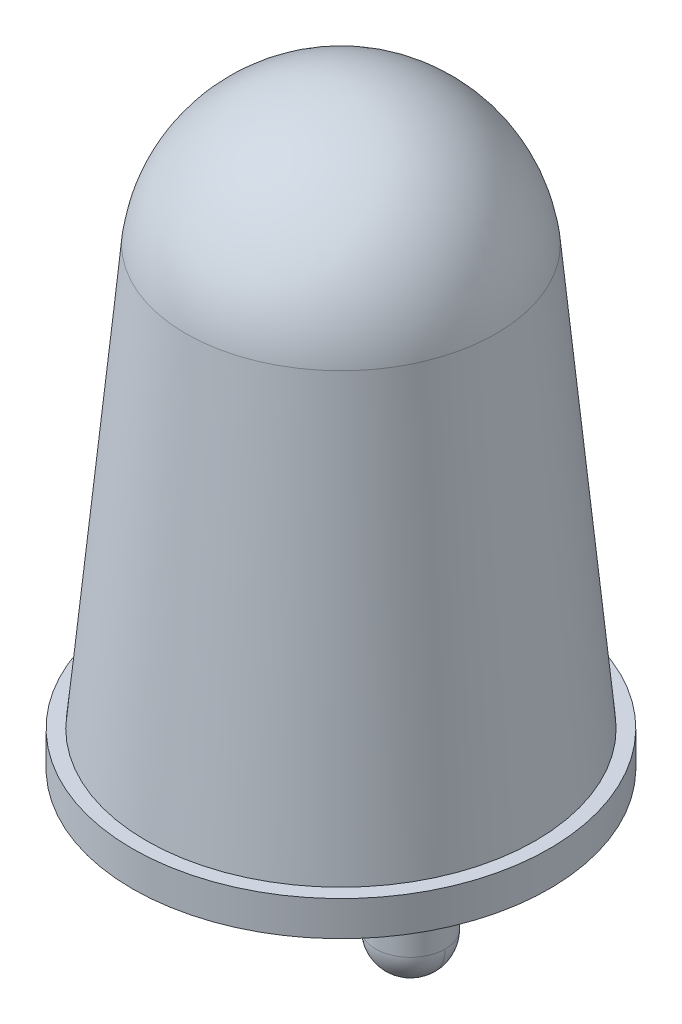
ISO-10303-21;
HEADER;
FILE_DESCRIPTION(('STEP AP214'),'2;1');
FILE_NAME('part.step','',(''),(''),'','','');
FILE_SCHEMA(('AUTOMOTIVE_DESIGN { 1 0 10303 214 1 1 1 1 }'));
ENDSEC;
DATA;
#1=APPLICATION_CONTEXT('core data for automotive mechanical design processes');
#2=APPLICATION_PROTOCOL_DEFINITION('international standard','automotive_design',2000,#1);
#3=PRODUCT_CONTEXT('',#1,'mechanical');
#4=PRODUCT('Part','Part','',(#3));
#5=PRODUCT_RELATED_PRODUCT_CATEGORY('part','',(#4));
#6=PRODUCT_DEFINITION_FORMATION('','',#4);
#7=PRODUCT_DEFINITION_CONTEXT('part definition',#1,'design');
#8=PRODUCT_DEFINITION('design','',#6,#7);
#9=PRODUCT_DEFINITION_SHAPE('','',#8);
#10=(LENGTH_UNIT() NAMED_UNIT(*) SI_UNIT(.MILLI.,.METRE.));
#11=(NAMED_UNIT(*) PLANE_ANGLE_UNIT() SI_UNIT($,.RADIAN.));
#12=(NAMED_UNIT(*) SI_UNIT($,.STERADIAN.) SOLID_ANGLE_UNIT());
#13=UNCERTAINTY_MEASURE_WITH_UNIT(LENGTH_MEASURE(1.E-05),#10,'distance_accuracy_value','');
#14=(GEOMETRIC_REPRESENTATION_CONTEXT(3) GLOBAL_UNCERTAINTY_ASSIGNED_CONTEXT((#13)) GLOBAL_UNIT_ASSIGNED_CONTEXT((#10,
#11,#12)) REPRESENTATION_CONTEXT('',''));
#15=CARTESIAN_POINT('',(0.,0.,0.));
#16=DIRECTION('',(0.,0.,1.));
#17=DIRECTION('',(1.,0.,0.));
#18=AXIS2_PLACEMENT_3D('',#15,#16,#17);
#19=CARTESIAN_POINT('',(-1.,-1.5,0.));
#20=DIRECTION('',(1.,0.,-6.292242297362E-10));
#21=DIRECTION('',(6.292242297362E-10,0.,1.));
#22=AXIS2_PLACEMENT_3D('',#19,#20,#21);
#23=SPHERICAL_SURFACE('',#22,0.5);
#24=CARTESIAN_POINT('',(-0.5,-1.5,-3.14612158236078E-10));
#25=CARTESIAN_POINT('',(-0.499999826455612,-1.50818123913036,3.60818262114439E-08));
#26=CARTESIAN_POINT('',(-0.500200791437424,-1.51636246349381,7.13371394644627E-08));
#27=CARTESIAN_POINT('',(-0.501003752357404,-1.53270521083316,1.39492114832227E-07));
#28=CARTESIAN_POINT('',(-0.501605748295573,-1.54086673380906,1.72391776946973E-07));
#29=CARTESIAN_POINT('',(-0.50320952503223,-1.55715040651965,2.3576204913324E-07));
#30=CARTESIAN_POINT('',(-0.504211305830718,-1.56527255625432,2.66232659204762E-07));
#31=CARTESIAN_POINT('',(-0.506612184204501,-1.58145791819985,3.24685718790203E-07));
#32=CARTESIAN_POINT('',(-0.508011281779797,-1.58952113041069,3.52668168304123E-07));
#33=CARTESIAN_POINT('',(-0.511203437816972,-1.60556919160396,4.06096412620439E-07));
#34=CARTESIAN_POINT('',(-0.512996496278851,-1.61355404058638,4.31542207422835E-07));
#35=CARTESIAN_POINT('',(-0.516972250526604,-1.62942613931517,4.79860348087767E-07));
#36=CARTESIAN_POINT('',(-0.519154946312478,-1.63731338906154,5.02732693950302E-07));
#37=CARTESIAN_POINT('',(-0.523904717955313,-1.65297128819103,5.45878600492865E-07));
#38=CARTESIAN_POINT('',(-0.526471793812275,-1.66074193757416,5.66152161172893E-07));
#39=CARTESIAN_POINT('',(-0.531984141004704,-1.67614791581603,6.04086680887956E-07));
#40=CARTESIAN_POINT('',(-0.534929412340169,-1.68378324467478,6.2174763992299E-07));
#41=CARTESIAN_POINT('',(-0.541191055148543,-1.69890018768818,6.5445458943054E-07));
#42=CARTESIAN_POINT('',(-0.544507426621451,-1.70638180184284,6.69500579903054E-07));
#43=CARTESIAN_POINT('',(-0.551503280255105,-1.72117329158526,6.96986588710274E-07));
#44=CARTESIAN_POINT('',(-0.555182762415851,-1.72848316717301,7.09426607044979E-07));
#45=CARTESIAN_POINT('',(-0.562895973235794,-1.74291356965079,7.31720899558749E-07));
#46=CARTESIAN_POINT('',(-0.566929701894993,-1.75003409654081,7.41575173737814E-07));
#47=CARTESIAN_POINT('',(-0.575341688104735,-1.76406864765023,7.587292679954E-07));
#48=CARTESIAN_POINT('',(-0.57971994565528,-1.77098267186962,7.66029088073921E-07));
#49=CARTESIAN_POINT('',(-0.588810442042175,-1.78458756114783,7.78116418370111E-07));
#50=CARTESIAN_POINT('',(-0.593522680878526,-1.79127842620665,7.82903928587779E-07));
#51=CARTESIAN_POINT('',(-0.603269787640829,-1.80442087828371,7.90019391948207E-07));
#52=CARTESIAN_POINT('',(-0.608304655566782,-1.81087246530197,7.92347345090967E-07));
#53=CARTESIAN_POINT('',(-0.618684891070481,-1.82352081885969,7.94606773948649E-07));
#54=CARTESIAN_POINT('',(-0.624030258648228,-1.82971758539917,7.94538249663571E-07));
#55=CARTESIAN_POINT('',(-0.635018615996813,-1.84184136944597,7.92077812625249E-07));
#56=CARTESIAN_POINT('',(-0.640661605767652,-1.8477683869533,7.89685899872005E-07));
#57=CARTESIAN_POINT('',(-0.6522316130458,-1.8593383942315,7.82661432230481E-07));
#58=CARTESIAN_POINT('',(-0.658158630553109,-1.86498138400236,7.78028877342201E-07));
#59=CARTESIAN_POINT('',(-0.670282414599873,-1.87596974135099,7.6661514467109E-07));
#60=CARTESIAN_POINT('',(-0.67647918113933,-1.88131510892876,7.59833966888258E-07));
#61=CARTESIAN_POINT('',(-0.689127534697025,-1.89169534443251,7.44223863843027E-07));
#62=CARTESIAN_POINT('',(-0.695579121715264,-1.89673021235849,7.35394938580626E-07));
#63=CARTESIAN_POINT('',(-0.708721573792303,-1.90647731912084,7.15798625560007E-07));
#64=CARTESIAN_POINT('',(-0.715412438851104,-1.91118955795722,7.05031237801788E-07));
#65=CARTESIAN_POINT('',(-0.729017328129294,-1.92028005434417,6.81675219136448E-07));
#66=CARTESIAN_POINT('',(-0.735931352348685,-1.92465831189474,6.69086588229327E-07));
#67=CARTESIAN_POINT('',(-0.749965903458094,-1.93307029810453,6.42212734367808E-07));
#68=CARTESIAN_POINT('',(-0.757086430348113,-1.93710402676376,6.27927511413409E-07));
#69=CARTESIAN_POINT('',(-0.771516832825889,-1.94481723758375,5.97792029183163E-07));
#70=CARTESIAN_POINT('',(-0.778826708413647,-1.94849671974452,5.81941769907316E-07));
#71=CARTESIAN_POINT('',(-0.793618198156072,-1.95549257337822,5.4881412427436E-07));
#72=CARTESIAN_POINT('',(-0.80109981231074,-1.95880894485115,5.31536737917252E-07));
#73=CARTESIAN_POINT('',(-0.816216755324171,-1.96507058765957,4.95698528091257E-07));
#74=CARTESIAN_POINT('',(-0.823852084182934,-1.96801585899505,4.77137704622369E-07));
#75=CARTESIAN_POINT('',(-0.839258062424846,-1.97352820618752,4.38881499965969E-07));
#76=CARTESIAN_POINT('',(-0.847028711807996,-1.9760952820445,4.19186118778454E-07));
#77=CARTESIAN_POINT('',(-0.862686610937542,-1.98084505368737,3.78814256649633E-07));
#78=CARTESIAN_POINT('',(-0.870573860683939,-1.98302774947326,3.58137775708325E-07));
#79=CARTESIAN_POINT('',(-0.886445959412797,-1.98700350372105,3.15961127899971E-07));
#80=CARTESIAN_POINT('',(-0.894430808395259,-1.98879656218294,2.94460961032926E-07));
#81=CARTESIAN_POINT('',(-0.910478869588613,-1.99198871822014,2.50797666912879E-07));
#82=CARTESIAN_POINT('',(-0.918542081799506,-1.99338781579545,2.28634539659877E-07));
#83=CARTESIAN_POINT('',(-0.934727443745133,-1.99578869416925,1.83808729850498E-07));
#84=CARTESIAN_POINT('',(-0.942849593479867,-1.99679047496774,1.6114604729412E-07));
#85=CARTESIAN_POINT('',(-0.959133266190573,-1.99839425170441,1.15486491064179E-07));
#86=CARTESIAN_POINT('',(-0.967294789166545,-1.99899624764259,9.24896173906148E-08));
#87=CARTESIAN_POINT('',(-0.983637536506037,-1.99979920856258,4.63285654720946E-08));
#88=CARTESIAN_POINT('',(-0.991818760869555,-2.00000017354439,2.31643872271384E-08));
#89=CARTESIAN_POINT('',(-1.,-2.,0.));
#90=B_SPLINE_CURVE_WITH_KNOTS('',3,(#24,#25,#26,#27,#28,#29,#30,#31,#32,#33,#34,#35,#36,#37,#38,
#39,#40,#41,#42,#43,#44,#45,#46,#47,#48,#49,#50,#51,#52,#53,#54,#55,#56,#57,#58,#59,#60,#61,#62,
#63,#64,#65,#66,#67,#68,#69,#70,#71,#72,#73,#74,#75,#76,#77,#78,#79,#80,#81,#82,#83,#84,#85,#86,
#87,#88,#89),.UNSPECIFIED.,.F.,.F.,(4,2,2,2,2,2,2,2,2,2,2,2,2,2,2,2,2,2,2,2,2,2,2,2,2,2,2,2,2,2,
2,2,4),(0.,0.0245412285229124,0.0490824570458252,0.0736236855687388,0.0981649140916539,
0.122706142614571,0.14724737113749,0.171788599660412,0.196329828183337,0.220871056706266,
0.245412285229198,0.269953513752134,0.294494742275074,0.319035970798019,0.343577199320968,
0.368118427843923,0.392659656366882,0.417200884889845,0.441742113412814,0.466283341935787,
0.490824570458765,0.515365798981748,0.539907027504735,0.564448256027726,0.58898948455072,
0.613530713073718,0.638071941596719,0.662613170119723,0.687154398642728,0.711695627165736,
0.736236855688746,0.760778084211756,0.785319312734766),.UNSPECIFIED.);
#91=CARTESIAN_POINT('',(-0.5,-1.5,-7.86530625211469E-11));
#92=VERTEX_POINT('',#91);
#93=CARTESIAN_POINT('',(-1.,-2.,0.));
#94=VERTEX_POINT('',#93);
#95=EDGE_CURVE('E62',#92,#94,#90,.T.);
#96=ORIENTED_EDGE('',*,*,#95,.F.);
#97=CARTESIAN_POINT('',(-1.,-1.5,0.));
#98=DIRECTION('',(0.,-1.,0.));
#99=DIRECTION('',(0.,0.,-1.));
#100=AXIS2_PLACEMENT_3D('',#97,#98,#99);
#101=CIRCLE('',#100,0.5);
#102=CARTESIAN_POINT('',(-1.5,-1.5,1.1797961674395E-10));
#103=VERTEX_POINT('',#102);
#104=EDGE_CURVE('E57',#103,#92,#101,.F.);
#105=ORIENTED_EDGE('',*,*,#104,.F.);
#106=CARTESIAN_POINT('',(-1.,-2.,0.));
#107=CARTESIAN_POINT('',(-1.00818123913044,-2.00000017354439,-2.31643873372575E-08));
#108=CARTESIAN_POINT('',(-1.01636246349396,-1.99979920856258,-4.63285656224641E-08));
#109=CARTESIAN_POINT('',(-1.03270521083345,-1.99899624764259,-9.24896175843399E-08));
#110=CARTESIAN_POINT('',(-1.04086673380943,-1.99839425170441,-1.15486491261009E-07));
#111=CARTESIAN_POINT('',(-1.05715040652013,-1.99679047496774,-1.61146047440141E-07));
#112=CARTESIAN_POINT('',(-1.06527255625487,-1.99578869416925,-1.83808729942604E-07));
#113=CARTESIAN_POINT('',(-1.08145791820049,-1.99338781579545,-2.28634539688911E-07));
#114=CARTESIAN_POINT('',(-1.08952113041139,-1.99198871822014,-2.50797666932755E-07));
#115=CARTESIAN_POINT('',(-1.10556919160474,-1.98879656218294,-2.94460961133162E-07));
#116=CARTESIAN_POINT('',(-1.1135540405872,-1.98700350372105,-3.15961128089725E-07));
#117=CARTESIAN_POINT('',(-1.12942613931606,-1.98302774947326,-3.58137775852755E-07));
#118=CARTESIAN_POINT('',(-1.13731338906246,-1.98084505368737,-3.78814256659222E-07));
#119=CARTESIAN_POINT('',(-1.152971288192,-1.9760952820445,-4.19186118673573E-07));
#120=CARTESIAN_POINT('',(-1.16074193757515,-1.97352820618752,-4.38881499881456E-07));
#121=CARTESIAN_POINT('',(-1.17614791581707,-1.96801585899505,-4.77137704613123E-07));
#122=CARTESIAN_POINT('',(-1.18378324467583,-1.96507058765957,-4.95698528136907E-07));
#123=CARTESIAN_POINT('',(-1.19890018768926,-1.95880894485115,-5.31536737984744E-07));
#124=CARTESIAN_POINT('',(-1.20638180184393,-1.95549257337822,-5.48814124308798E-07));
#125=CARTESIAN_POINT('',(-1.22117329158635,-1.94849671974452,-5.81941769983585E-07));
#126=CARTESIAN_POINT('',(-1.22848316717411,-1.94481723758375,-5.97792029334317E-07));
#127=CARTESIAN_POINT('',(-1.24291356965189,-1.93710402676376,-6.27927511566086E-07));
#128=CARTESIAN_POINT('',(-1.25003409654191,-1.93307029810453,-6.42212734447122E-07));
#129=CARTESIAN_POINT('',(-1.26406864765132,-1.92465831189474,-6.69086588255055E-07));
#130=CARTESIAN_POINT('',(-1.27098267187071,-1.92028005434417,-6.81675219181952E-07));
#131=CARTESIAN_POINT('',(-1.2845875611489,-1.91118955795722,-7.0503123785811E-07));
#132=CARTESIAN_POINT('',(-1.2912784262077,-1.90647731912084,-7.15798625607372E-07));
#133=CARTESIAN_POINT('',(-1.30442087828474,-1.89673021235849,-7.35394938631626E-07));
#134=CARTESIAN_POINT('',(-1.31087246530298,-1.89169534443251,-7.44223863906618E-07));
#135=CARTESIAN_POINT('',(-1.32352081886067,-1.88131510892876,-7.59833966919333E-07));
#136=CARTESIAN_POINT('',(-1.32971758540013,-1.87596974135099,-7.66615144657057E-07));
#137=CARTESIAN_POINT('',(-1.34184136944689,-1.86498138400236,-7.78028877282451E-07));
#138=CARTESIAN_POINT('',(-1.3477683869542,-1.8593383942315,-7.82661432170123E-07));
#139=CARTESIAN_POINT('',(-1.35933839423235,-1.8477683869533,-7.89685899861949E-07));
#140=CARTESIAN_POINT('',(-1.36498138400319,-1.84184136944597,-7.92077812666103E-07));
#141=CARTESIAN_POINT('',(-1.37596974135177,-1.82971758539917,-7.9453824970496E-07));
#142=CARTESIAN_POINT('',(-1.38131510892952,-1.82352081885969,-7.94606773939664E-07));
#143=CARTESIAN_POINT('',(-1.39169534443322,-1.81087246530197,-7.9234734503678E-07));
#144=CARTESIAN_POINT('',(-1.39673021235917,-1.80442087828371,-7.90019391899193E-07));
#145=CARTESIAN_POINT('',(-1.40647731912147,-1.79127842620665,-7.82903928577473E-07));
#146=CARTESIAN_POINT('',(-1.41118955795782,-1.78458756114783,-7.7811641839334E-07));
#147=CARTESIAN_POINT('',(-1.42028005434472,-1.77098267186962,-7.6602908811873E-07));
#148=CARTESIAN_POINT('',(-1.42465831189526,-1.76406864765023,-7.58729268028254E-07));
#149=CARTESIAN_POINT('',(-1.43307029810501,-1.75003409654081,-7.41575173767921E-07));
#150=CARTESIAN_POINT('',(-1.43710402676421,-1.74291356965079,-7.31720899598065E-07));
#151=CARTESIAN_POINT('',(-1.44481723758415,-1.72848316717301,-7.09426607063392E-07));
#152=CARTESIAN_POINT('',(-1.4484967197449,-1.72117329158526,-6.96986588698576E-07));
#153=CARTESIAN_POINT('',(-1.45549257337855,-1.70638180184284,-6.69500579872176E-07));
#154=CARTESIAN_POINT('',(-1.45880894485146,-1.69890018768818,-6.54454589410592E-07));
#155=CARTESIAN_POINT('',(-1.46507058765983,-1.68378324467478,-6.2174763990483E-07));
#156=CARTESIAN_POINT('',(-1.4680158589953,-1.67614791581603,-6.04086680860651E-07));
#157=CARTESIAN_POINT('',(-1.47352820618772,-1.66074193757416,-5.6615216116665E-07));
#158=CARTESIAN_POINT('',(-1.47609528204469,-1.65297128819103,-5.45878600516828E-07));
#159=CARTESIAN_POINT('',(-1.48084505368752,-1.63731338906154,-5.02732693961889E-07));
#160=CARTESIAN_POINT('',(-1.4830277494734,-1.62942613931517,-4.79860348056773E-07));
#161=CARTESIAN_POINT('',(-1.48700350372115,-1.61355404058638,-4.31542207375679E-07));
#162=CARTESIAN_POINT('',(-1.48879656218303,-1.60556919160396,-4.06096412599701E-07));
#163=CARTESIAN_POINT('',(-1.4919887182202,-1.58952113041069,-3.52668168305435E-07));
#164=CARTESIAN_POINT('',(-1.4933878157955,-1.58145791819985,-3.24685718787146E-07));
#165=CARTESIAN_POINT('',(-1.49578869416928,-1.56527255625432,-2.66232659193207E-07));
#166=CARTESIAN_POINT('',(-1.49679047496777,-1.55715040651965,-2.35762049117556E-07));
#167=CARTESIAN_POINT('',(-1.49839425170443,-1.54086673380906,-1.72391776931132E-07));
#168=CARTESIAN_POINT('',(-1.4989962476426,-1.53270521083316,-1.39492114820359E-07));
#169=CARTESIAN_POINT('',(-1.49979920856258,-1.51636246349381,-7.13371394605478E-08));
#170=CARTESIAN_POINT('',(-1.50000017354439,-1.50818123913036,-3.60818262115087E-08));
#171=CARTESIAN_POINT('',(-1.5,-1.5,3.1461215823635E-10));
#172=B_SPLINE_CURVE_WITH_KNOTS('',3,(#106,#107,#108,#109,#110,#111,#112,#113,#114,#115,#116,
#117,#118,#119,#120,#121,#122,#123,#124,#125,#126,#127,#128,#129,#130,#131,#132,#133,#134,#135,
#136,#137,#138,#139,#140,#141,#142,#143,#144,#145,#146,#147,#148,#149,#150,#151,#152,#153,#154,
#155,#156,#157,#158,#159,#160,#161,#162,#163,#164,#165,#166,#167,#168,#169,#170,#171),
.UNSPECIFIED.,.F.,.F.,(4,2,2,2,2,2,2,2,2,2,2,2,2,2,2,2,2,2,2,2,2,2,2,2,2,2,2,2,2,2,2,2,4),(0.,
0.0245412285230105,0.0490824570460207,0.0736236855690299,0.0981649140920376,0.122706142615044,
0.147247371138047,0.171788599661048,0.196329828184046,0.220871056707041,0.245412285230032,
0.269953513753018,0.294494742276001,0.319035970798979,0.343577199321952,0.368118427844921,
0.392659656367885,0.417200884890844,0.441742113413798,0.466283341936747,0.490824570459692,
0.515365798982633,0.539907027505569,0.564448256028501,0.588989484551429,0.613530713074354,
0.638071941597276,0.662613170120195,0.687154398643112,0.711695627166027,0.736236855688941,
0.760778084211854,0.785319312734766),.UNSPECIFIED.);
#173=EDGE_CURVE('E48',#94,#103,#172,.T.);
#174=ORIENTED_EDGE('',*,*,#173,.F.);
#175=EDGE_LOOP('',(#96,#105,#174));
#176=FACE_BOUND('',#175,.T.);
#177=ADVANCED_FACE('F16',(#176),#23,.T.);
#178=CARTESIAN_POINT('',(-1.,-1.5,0.));
#179=DIRECTION('',(-1.,0.,6.292243164727E-10));
#180=DIRECTION('',(-6.292243164727E-10,0.,-1.));
#181=AXIS2_PLACEMENT_3D('',#178,#179,#180);
#182=SPHERICAL_SURFACE('',#181,0.5);
#183=ORIENTED_EDGE('',*,*,#173,.T.);
#184=CARTESIAN_POINT('',(-1.,-1.5,0.));
#185=DIRECTION('',(0.,-1.,0.));
#186=DIRECTION('',(0.,0.,-1.));
#187=AXIS2_PLACEMENT_3D('',#184,#185,#186);
#188=CIRCLE('',#187,0.5);
#189=EDGE_CURVE('E91',#92,#103,#188,.F.);
#190=ORIENTED_EDGE('',*,*,#189,.F.);
#191=ORIENTED_EDGE('',*,*,#95,.T.);
#192=EDGE_LOOP('',(#183,#190,#191));
#193=FACE_BOUND('',#192,.T.);
#194=ADVANCED_FACE('F114',(#193),#182,.T.);
#195=CARTESIAN_POINT('',(1.,-1.5,0.));
#196=DIRECTION('',(1.,0.,-6.29224262696E-10));
#197=DIRECTION('',(6.29224262696E-10,0.,1.));
#198=AXIS2_PLACEMENT_3D('',#195,#196,#197);
#199=SPHERICAL_SURFACE('',#198,0.5);
#200=CARTESIAN_POINT('',(1.5,-1.5,-3.14612148261378E-10));
#201=CARTESIAN_POINT('',(1.50000017354439,-1.50818123913036,3.60818250545824E-08));
#202=CARTESIAN_POINT('',(1.49979920856258,-1.51636246349381,7.13371371907104E-08));
#203=CARTESIAN_POINT('',(1.4989962476426,-1.53270521083316,1.39492110403559E-07));
#204=CARTESIAN_POINT('',(1.49839425170443,-1.54086673380906,1.7239177148028E-07));
#205=CARTESIAN_POINT('',(1.49679047496777,-1.55715040651965,2.35762041648338E-07));
#206=CARTESIAN_POINT('',(1.49578869416928,-1.56527255625432,2.66232650739675E-07));
#207=CARTESIAN_POINT('',(1.4933878157955,-1.58145791819985,3.24685708475954E-07));
#208=CARTESIAN_POINT('',(1.4919887182202,-1.58952113041069,3.52668157120896E-07));
#209=CARTESIAN_POINT('',(1.48879656218303,-1.60556919160396,4.06096399738005E-07));
#210=CARTESIAN_POINT('',(1.48700350372115,-1.61355404058638,4.31542193710173E-07));
#211=CARTESIAN_POINT('',(1.4830277494734,-1.62942613931517,4.79860332847321E-07));
#212=CARTESIAN_POINT('',(1.48084505368752,-1.63731338906154,5.02732678012302E-07));
#213=CARTESIAN_POINT('',(1.47609528204469,-1.65297128819103,5.45878583190584E-07));
#214=CARTESIAN_POINT('',(1.47352820618772,-1.66074193757416,5.66152143203887E-07));
#215=CARTESIAN_POINT('',(1.4680158589953,-1.67614791581603,6.04086661697872E-07));
#216=CARTESIAN_POINT('',(1.46507058765983,-1.68378324467478,6.21747620178555E-07));
#217=CARTESIAN_POINT('',(1.45880894485146,-1.69890018768818,6.54454568661384E-07));
#218=CARTESIAN_POINT('',(1.45549257337855,-1.70638180184284,6.69500558663531E-07));
#219=CARTESIAN_POINT('',(1.4484967197449,-1.72117329158526,6.96986566581941E-07));
#220=CARTESIAN_POINT('',(1.44481723758415,-1.72848316717301,7.09426584498203E-07));
#221=CARTESIAN_POINT('',(1.43710402676421,-1.74291356965079,7.31720876277176E-07));
#222=CARTESIAN_POINT('',(1.43307029810501,-1.75003409654081,7.41575150139885E-07));
#223=CARTESIAN_POINT('',(1.42465831189526,-1.76406864765023,7.58729243894177E-07));
#224=CARTESIAN_POINT('',(1.42028005434472,-1.77098267186962,7.66029063785758E-07));
#225=CARTESIAN_POINT('',(1.41118955795783,-1.78458756114783,7.78116393700396E-07));
#226=CARTESIAN_POINT('',(1.40647731912147,-1.79127842620665,7.82903903723451E-07));
#227=CARTESIAN_POINT('',(1.39673021235917,-1.80442087828371,7.90019366829811E-07));
#228=CARTESIAN_POINT('',(1.39169534443322,-1.81087246530197,7.92347319913116E-07));
#229=CARTESIAN_POINT('',(1.38131510892952,-1.82352081885969,7.9460674871275E-07));
#230=CARTESIAN_POINT('',(1.37596974135177,-1.82971758539917,7.94538224429079E-07));
#231=CARTESIAN_POINT('',(1.36498138400319,-1.84184136944597,7.92077787473301E-07));
#232=CARTESIAN_POINT('',(1.35933839423235,-1.8477683869533,7.89685874801192E-07));
#233=CARTESIAN_POINT('',(1.3477683869542,-1.8593383942315,7.8266140738646E-07));
#234=CARTESIAN_POINT('',(1.34184136944689,-1.86498138400236,7.78028852643835E-07));
#235=CARTESIAN_POINT('',(1.32971758540013,-1.87596974135099,7.66615120354642E-07));
#236=CARTESIAN_POINT('',(1.32352081886067,-1.88131510892876,7.59833942808074E-07));
#237=CARTESIAN_POINT('',(1.31087246530298,-1.89169534443251,7.44223840219168E-07));
#238=CARTESIAN_POINT('',(1.30442087828474,-1.89673021235849,7.35394915176831E-07));
#239=CARTESIAN_POINT('',(1.2912784262077,-1.90647731912084,7.15798602783579E-07));
#240=CARTESIAN_POINT('',(1.2845875611489,-1.91118955795722,7.05031215432664E-07));
#241=CARTESIAN_POINT('',(1.27098267187071,-1.92028005434417,6.816751975763E-07));
#242=CARTESIAN_POINT('',(1.26406864765132,-1.92465831189474,6.6908656707085E-07));
#243=CARTESIAN_POINT('',(1.25003409654191,-1.93307029810453,6.42212714017567E-07));
#244=CARTESIAN_POINT('',(1.24291356965189,-1.93710402676376,6.27927491469734E-07));
#245=CARTESIAN_POINT('',(1.22848316717411,-1.94481723758375,5.97792010166897E-07));
#246=CARTESIAN_POINT('',(1.22117329158635,-1.94849671974452,5.81941751411893E-07));
#247=CARTESIAN_POINT('',(1.20638180184393,-1.95549257337822,5.48814106848369E-07));
#248=CARTESIAN_POINT('',(1.19890018768926,-1.95880894485115,5.31536721039849E-07));
#249=CARTESIAN_POINT('',(1.18378324467583,-1.96507058765957,4.95698512358641E-07));
#250=CARTESIAN_POINT('',(1.17614791581707,-1.96801585899505,4.77137689485953E-07));
#251=CARTESIAN_POINT('',(1.16074193757515,-1.97352820618752,4.38881486049102E-07));
#252=CARTESIAN_POINT('',(1.152971288192,-1.9760952820445,4.19186105484938E-07));
#253=CARTESIAN_POINT('',(1.13731338906246,-1.98084505368737,3.7881424466341E-07));
#254=CARTESIAN_POINT('',(1.12942613931606,-1.98302774947326,3.58137764406045E-07));
#255=CARTESIAN_POINT('',(1.1135540405872,-1.98700350372105,3.15961117883467E-07));
#256=CARTESIAN_POINT('',(1.10556919160474,-1.98879656218294,2.94460951618254E-07));
#257=CARTESIAN_POINT('',(1.08952113041139,-1.99198871822014,2.50797658909197E-07));
#258=CARTESIAN_POINT('',(1.08145791820049,-1.99338781579545,2.28634532465353E-07));
#259=CARTESIAN_POINT('',(1.06527255625487,-1.99578869416925,1.83808724089111E-07));
#260=CARTESIAN_POINT('',(1.05715040652013,-1.99679047496774,1.61146042156713E-07));
#261=CARTESIAN_POINT('',(1.04086673380943,-1.99839425170441,1.15486487364526E-07));
#262=CARTESIAN_POINT('',(1.03270521083345,-1.99899624764259,9.24896145047369E-08));
#263=CARTESIAN_POINT('',(1.01636246349396,-1.99979920856258,4.63285641451856E-08));
#264=CARTESIAN_POINT('',(1.00818123913045,-2.00000017354439,2.31643866454234E-08));
#265=CARTESIAN_POINT('',(1.,-2.,0.));
#266=B_SPLINE_CURVE_WITH_KNOTS('',3,(#200,#201,#202,#203,#204,#205,#206,#207,#208,#209,#210,
#211,#212,#213,#214,#215,#216,#217,#218,#219,#220,#221,#222,#223,#224,#225,#226,#227,#228,#229,
#230,#231,#232,#233,#234,#235,#236,#237,#238,#239,#240,#241,#242,#243,#244,#245,#246,#247,#248,
#249,#250,#251,#252,#253,#254,#255,#256,#257,#258,#259,#260,#261,#262,#263,#264,#265),
.UNSPECIFIED.,.F.,.F.,(4,2,2,2,2,2,2,2,2,2,2,2,2,2,2,2,2,2,2,2,2,2,2,2,2,2,2,2,2,2,2,2,4),(0.,
0.0245412285229124,0.0490824570458252,0.0736236855687388,0.0981649140916539,0.122706142614571,
0.14724737113749,0.171788599660412,0.196329828183337,0.220871056706266,0.245412285229198,
0.269953513752134,0.294494742275074,0.319035970798019,0.343577199320968,0.368118427843923,
0.392659656366882,0.417200884889845,0.441742113412814,0.466283341935787,0.490824570458765,
0.515365798981748,0.539907027504735,0.564448256027725,0.58898948455072,0.613530713073718,
0.638071941596719,0.662613170119723,0.687154398642728,0.711695627165736,0.736236855688746,
0.760778084211756,0.785319312734766),.UNSPECIFIED.);
#267=CARTESIAN_POINT('',(1.5,-1.5,-7.86530600274719E-11));
#268=VERTEX_POINT('',#267);
#269=CARTESIAN_POINT('',(1.,-2.,0.));
#270=VERTEX_POINT('',#269);
#271=EDGE_CURVE('E35',#268,#270,#266,.T.);
#272=ORIENTED_EDGE('',*,*,#271,.F.);
#273=CARTESIAN_POINT('',(1.,-1.5,0.));
#274=DIRECTION('',(0.,-1.,0.));
#275=DIRECTION('',(0.,0.,-1.));
#276=AXIS2_PLACEMENT_3D('',#273,#274,#275);
#277=CIRCLE('',#276,0.5);
#278=CARTESIAN_POINT('',(0.5,-1.5,1.17979613003437E-10));
#279=VERTEX_POINT('',#278);
#280=EDGE_CURVE('E53',#279,#268,#277,.F.);
#281=ORIENTED_EDGE('',*,*,#280,.F.);
#282=CARTESIAN_POINT('',(1.,-2.,0.));
#283=CARTESIAN_POINT('',(0.991818760869555,-2.00000017354439,-2.31643865975994E-08));
#284=CARTESIAN_POINT('',(0.983637536506037,-1.99979920856258,-4.6328564142658E-08));
#285=CARTESIAN_POINT('',(0.967294789166546,-1.99899624764259,-9.24896146295823E-08));
#286=CARTESIAN_POINT('',(0.959133266190573,-1.99839425170441,-1.15486487571448E-07));
#287=CARTESIAN_POINT('',(0.942849593479867,-1.99679047496774,-1.61146042292641E-07));
#288=CARTESIAN_POINT('',(0.934727443745133,-1.99578869416925,-1.83808724071968E-07));
#289=CARTESIAN_POINT('',(0.918542081799506,-1.99338781579545,-2.28634532383995E-07));
#290=CARTESIAN_POINT('',(0.910478869588613,-1.99198871822014,-2.50797658916695E-07));
#291=CARTESIAN_POINT('',(0.894430808395259,-1.98879656218294,-2.94460951730867E-07));
#292=CARTESIAN_POINT('',(0.886445959412797,-1.98700350372105,-3.15961118012338E-07));
#293=CARTESIAN_POINT('',(0.870573860683939,-1.98302774947326,-3.58137764395969E-07));
#294=CARTESIAN_POINT('',(0.862686610937542,-1.98084505368737,-3.78814244498128E-07));
#295=CARTESIAN_POINT('',(0.847028711807996,-1.9760952820445,-4.19186105342446E-07));
#296=CARTESIAN_POINT('',(0.839258062424846,-1.97352820618752,-4.38881486084605E-07));
#297=CARTESIAN_POINT('',(0.823852084182934,-1.96801585899505,-4.77137689565755E-07));
#298=CARTESIAN_POINT('',(0.816216755324171,-1.96507058765957,-4.95698512304745E-07));
#299=CARTESIAN_POINT('',(0.80109981231074,-1.95880894485115,-5.31536721001746E-07));
#300=CARTESIAN_POINT('',(0.793618198156072,-1.95549257337822,-5.48814106959756E-07));
#301=CARTESIAN_POINT('',(0.778826708413647,-1.94849671974452,-5.81941751611938E-07));
#302=CARTESIAN_POINT('',(0.771516832825889,-1.94481723758375,-5.97792010306109E-07));
#303=CARTESIAN_POINT('',(0.757086430348113,-1.93710402676376,-6.27927491438526E-07));
#304=CARTESIAN_POINT('',(0.749965903458094,-1.93307029810453,-6.42212713876773E-07));
#305=CARTESIAN_POINT('',(0.735931352348685,-1.92465831189474,-6.69086566935778E-07));
#306=CARTESIAN_POINT('',(0.729017328129294,-1.92028005434417,-6.81675197556537E-07));
#307=CARTESIAN_POINT('',(0.715412438851104,-1.91118955795722,-7.05031215554253E-07));
#308=CARTESIAN_POINT('',(0.708721573792303,-1.90647731912084,-7.1579860293121E-07));
#309=CARTESIAN_POINT('',(0.695579121715264,-1.89673021235849,-7.35394915305914E-07));
#310=CARTESIAN_POINT('',(0.689127534697025,-1.89169534443251,-7.44223840303662E-07));
#311=CARTESIAN_POINT('',(0.67647918113933,-1.88131510892876,-7.59833942818247E-07));
#312=CARTESIAN_POINT('',(0.670282414599873,-1.87596974135099,-7.66615120335086E-07));
#313=CARTESIAN_POINT('',(0.658158630553109,-1.86498138400236,-7.78028852589608E-07));
#314=CARTESIAN_POINT('',(0.6522316130458,-1.8593383942315,-7.82661407327292E-07));
#315=CARTESIAN_POINT('',(0.640661605767652,-1.8477683869533,-7.89685874789946E-07));
#316=CARTESIAN_POINT('',(0.635018615996813,-1.84184136944597,-7.92077787514918E-07));
#317=CARTESIAN_POINT('',(0.624030258648228,-1.82971758539917,-7.94538224469705E-07));
#318=CARTESIAN_POINT('',(0.618684891070481,-1.82352081885969,-7.94606748699521E-07));
#319=CARTESIAN_POINT('',(0.608304655566782,-1.81087246530197,-7.92347319863172E-07));
#320=CARTESIAN_POINT('',(0.603269787640829,-1.80442087828371,-7.90019366797007E-07));
#321=CARTESIAN_POINT('',(0.593522680878526,-1.79127842620665,-7.82903903696936E-07));
#322=CARTESIAN_POINT('',(0.588810442042175,-1.78458756114783,-7.7811639366303E-07));
#323=CARTESIAN_POINT('',(0.57971994565528,-1.77098267186962,-7.66029063767801E-07));
#324=CARTESIAN_POINT('',(0.575341688104735,-1.76406864765023,-7.58729243906478E-07));
#325=CARTESIAN_POINT('',(0.566929701894993,-1.75003409654081,-7.41575150190543E-07));
#326=CARTESIAN_POINT('',(0.562895973235794,-1.74291356965079,-7.31720876335931E-07));
#327=CARTESIAN_POINT('',(0.55518276241585,-1.72848316717301,-7.09426584497176E-07));
#328=CARTESIAN_POINT('',(0.551503280255105,-1.72117329158526,-6.96986566513034E-07));
#329=CARTESIAN_POINT('',(0.544507426621451,-1.70638180184284,-6.69500558594925E-07));
#330=CARTESIAN_POINT('',(0.541191055148543,-1.69890018768818,-6.54454568660959E-07));
#331=CARTESIAN_POINT('',(0.534929412340169,-1.68378324467478,-6.21747620225845E-07));
#332=CARTESIAN_POINT('',(0.531984141004703,-1.67614791581603,-6.04086661724699E-07));
#333=CARTESIAN_POINT('',(0.526471793812275,-1.66074193757416,-5.66152143218317E-07));
#334=CARTESIAN_POINT('',(0.523904717955313,-1.65297128819103,-5.45878583213082E-07));
#335=CARTESIAN_POINT('',(0.519154946312478,-1.63731338906154,-5.02732678025353E-07));
#336=CARTESIAN_POINT('',(0.516972250526604,-1.62942613931517,-4.79860332842859E-07));
#337=CARTESIAN_POINT('',(0.512996496278851,-1.61355404058638,-4.31542193690438E-07));
#338=CARTESIAN_POINT('',(0.511203437816972,-1.60556919160396,-4.06096399720512E-07));
#339=CARTESIAN_POINT('',(0.508011281779797,-1.58952113041069,-3.52668157118963E-07));
#340=CARTESIAN_POINT('',(0.506612184204501,-1.58145791819985,-3.2468570848734E-07));
#341=CARTESIAN_POINT('',(0.504211305830718,-1.56527255625432,-2.66232650746258E-07));
#342=CARTESIAN_POINT('',(0.50320952503223,-1.55715040651965,-2.35762041636798E-07));
#343=CARTESIAN_POINT('',(0.501605748295573,-1.54086673380906,-1.72391771460294E-07));
#344=CARTESIAN_POINT('',(0.501003752357404,-1.53270521083316,-1.39492110393251E-07));
#345=CARTESIAN_POINT('',(0.500200791437424,-1.51636246349381,-7.13371371961313E-08));
#346=CARTESIAN_POINT('',(0.499999826455612,-1.50818123913036,-3.60818250660553E-08));
#347=CARTESIAN_POINT('',(0.5,-1.5,3.1461214826165E-10));
#348=B_SPLINE_CURVE_WITH_KNOTS('',3,(#282,#283,#284,#285,#286,#287,#288,#289,#290,#291,#292,
#293,#294,#295,#296,#297,#298,#299,#300,#301,#302,#303,#304,#305,#306,#307,#308,#309,#310,#311,
#312,#313,#314,#315,#316,#317,#318,#319,#320,#321,#322,#323,#324,#325,#326,#327,#328,#329,#330,
#331,#332,#333,#334,#335,#336,#337,#338,#339,#340,#341,#342,#343,#344,#345,#346,#347),
.UNSPECIFIED.,.F.,.F.,(4,2,2,2,2,2,2,2,2,2,2,2,2,2,2,2,2,2,2,2,2,2,2,2,2,2,2,2,2,2,2,2,4),(0.,
0.0245412285230104,0.0490824570460208,0.0736236855690298,0.0981649140920377,0.122706142615044,
0.147247371138047,0.171788599661048,0.196329828184046,0.220871056707041,0.245412285230032,
0.269953513753018,0.294494742276001,0.319035970798979,0.343577199321952,0.368118427844921,
0.392659656367885,0.417200884890844,0.441742113413798,0.466283341936747,0.490824570459692,
0.515365798982633,0.539907027505569,0.564448256028501,0.588989484551429,0.613530713074354,
0.638071941597276,0.662613170120195,0.687154398643112,0.711695627166028,0.736236855688941,
0.760778084211854,0.785319312734766),.UNSPECIFIED.);
#349=EDGE_CURVE('E51',#270,#279,#348,.T.);
#350=ORIENTED_EDGE('',*,*,#349,.F.);
#351=EDGE_LOOP('',(#272,#281,#350));
#352=FACE_BOUND('',#351,.T.);
#353=ADVANCED_FACE('F52',(#352),#199,.T.);
#354=CARTESIAN_POINT('',(1.,-1.5,0.));
#355=DIRECTION('',(-1.,0.,6.292242965233E-10));
#356=DIRECTION('',(-6.292242965233E-10,0.,-1.));
#357=AXIS2_PLACEMENT_3D('',#354,#355,#356);
#358=SPHERICAL_SURFACE('',#357,0.5);
#359=ORIENTED_EDGE('',*,*,#349,.T.);
#360=CARTESIAN_POINT('',(1.,-1.5,0.));
#361=DIRECTION('',(0.,-1.,0.));
#362=DIRECTION('',(0.,0.,-1.));
#363=AXIS2_PLACEMENT_3D('',#360,#361,#362);
#364=CIRCLE('',#363,0.5);
#365=EDGE_CURVE('E60',#268,#279,#364,.F.);
#366=ORIENTED_EDGE('',*,*,#365,.F.);
#367=ORIENTED_EDGE('',*,*,#271,.T.);
#368=EDGE_LOOP('',(#359,#366,#367));
#369=FACE_BOUND('',#368,.T.);
#370=ADVANCED_FACE('F59',(#369),#358,.T.);
#371=CARTESIAN_POINT('',(-1.,0.,0.));
#372=DIRECTION('',(0.,-1.,0.));
#373=DIRECTION('',(0.,0.,-1.));
#374=AXIS2_PLACEMENT_3D('',#371,#372,#373);
#375=CYLINDRICAL_SURFACE('',#374,0.5);
#376=CARTESIAN_POINT('',(-1.,0.,0.));
#377=DIRECTION('',(0.,-1.,0.));
#378=DIRECTION('',(0.,0.,-1.));
#379=AXIS2_PLACEMENT_3D('',#376,#377,#378);
#380=CIRCLE('',#379,0.5);
#381=CARTESIAN_POINT('',(-1.,0.,-0.5));
#382=VERTEX_POINT('',#381);
#383=EDGE_CURVE('E20',#382,#382,#380,.T.);
#384=ORIENTED_EDGE('',*,*,#383,.T.);
#385=EDGE_LOOP('',(#384));
#386=FACE_BOUND('',#385,.T.);
#387=ORIENTED_EDGE('',*,*,#189,.T.);
#388=ORIENTED_EDGE('',*,*,#104,.T.);
#389=EDGE_LOOP('',(#387,#388));
#390=FACE_BOUND('',#389,.T.);
#391=ADVANCED_FACE('F82',(#386,#390),#375,.T.);
#392=CARTESIAN_POINT('',(1.,0.,0.));
#393=DIRECTION('',(0.,-1.,0.));
#394=DIRECTION('',(0.,0.,-1.));
#395=AXIS2_PLACEMENT_3D('',#392,#393,#394);
#396=CYLINDRICAL_SURFACE('',#395,0.5);
#397=CARTESIAN_POINT('',(1.,0.,0.));
#398=DIRECTION('',(0.,-1.,0.));
#399=DIRECTION('',(0.,0.,-1.));
#400=AXIS2_PLACEMENT_3D('',#397,#398,#399);
#401=CIRCLE('',#400,0.5);
#402=CARTESIAN_POINT('',(1.,0.,-0.5));
#403=VERTEX_POINT('',#402);
#404=EDGE_CURVE('E95',#403,#403,#401,.T.);
#405=ORIENTED_EDGE('',*,*,#404,.T.);
#406=EDGE_LOOP('',(#405));
#407=FACE_BOUND('',#406,.T.);
#408=ORIENTED_EDGE('',*,*,#365,.T.);
#409=ORIENTED_EDGE('',*,*,#280,.T.);
#410=EDGE_LOOP('',(#408,#409));
#411=FACE_BOUND('',#410,.T.);
#412=ADVANCED_FACE('F146',(#407,#411),#396,.T.);
#413=CARTESIAN_POINT('',(0.,0.,0.));
#414=DIRECTION('',(0.,1.,0.));
#415=DIRECTION('',(0.,0.,1.));
#416=AXIS2_PLACEMENT_3D('',#413,#414,#415);
#417=PLANE('',#416);
#418=ORIENTED_EDGE('',*,*,#404,.F.);
#419=EDGE_LOOP('',(#418));
#420=FACE_BOUND('',#419,.T.);
#421=ORIENTED_EDGE('',*,*,#383,.F.);
#422=EDGE_LOOP('',(#421));
#423=FACE_BOUND('',#422,.T.);
#424=CARTESIAN_POINT('',(0.,0.,0.));
#425=DIRECTION('',(0.,1.,0.));
#426=DIRECTION('',(0.,0.,1.));
#427=AXIS2_PLACEMENT_3D('',#424,#425,#426);
#428=CIRCLE('',#427,3.);
#429=CARTESIAN_POINT('',(0.,0.,3.));
#430=VERTEX_POINT('',#429);
#431=EDGE_CURVE('E99',#430,#430,#428,.T.);
#432=ORIENTED_EDGE('',*,*,#431,.F.);
#433=EDGE_LOOP('',(#432));
#434=FACE_BOUND('',#433,.T.);
#435=ADVANCED_FACE('F151',(#420,#423,#434),#417,.F.);
#436=CARTESIAN_POINT('',(0.,0.,0.));
#437=DIRECTION('',(0.,1.,0.));
#438=DIRECTION('',(0.,0.,1.));
#439=AXIS2_PLACEMENT_3D('',#436,#437,#438);
#440=CYLINDRICAL_SURFACE('',#439,3.);
#441=CARTESIAN_POINT('',(0.,0.5,0.));
#442=DIRECTION('',(0.,1.,0.));
#443=DIRECTION('',(0.,0.,1.));
#444=AXIS2_PLACEMENT_3D('',#441,#442,#443);
#445=CIRCLE('',#444,3.);
#446=CARTESIAN_POINT('',(0.,0.5,3.));
#447=VERTEX_POINT('',#446);
#448=EDGE_CURVE('E103',#447,#447,#445,.T.);
#449=ORIENTED_EDGE('',*,*,#448,.F.);
#450=EDGE_LOOP('',(#449));
#451=FACE_BOUND('',#450,.T.);
#452=ORIENTED_EDGE('',*,*,#431,.T.);
#453=EDGE_LOOP('',(#452));
#454=FACE_BOUND('',#453,.T.);
#455=ADVANCED_FACE('F167',(#451,#454),#440,.T.);
#456=CARTESIAN_POINT('',(0.,6.25,0.));
#457=DIRECTION('',(1.,0.,0.));
#458=DIRECTION('',(0.,0.,-1.));
#459=AXIS2_PLACEMENT_3D('',#456,#457,#458);
#460=SPHERICAL_SURFACE('',#459,2.25);
#461=CARTESIAN_POINT('',(0.,6.53408373443654,0.));
#462=DIRECTION('',(0.,-1.,0.));
#463=DIRECTION('',(0.,0.,-1.));
#464=AXIS2_PLACEMENT_3D('',#461,#462,#463);
#465=CIRCLE('',#464,2.23199382433496);
#466=CARTESIAN_POINT('',(0.,6.53408373443654,-2.23199382433496));
#467=VERTEX_POINT('',#466);
#468=EDGE_CURVE('E26',#467,#467,#465,.T.);
#469=ORIENTED_EDGE('',*,*,#468,.F.);
#470=EDGE_LOOP('',(#469));
#471=FACE_BOUND('',#470,.T.);
#472=ADVANCED_FACE('F160',(#471),#460,.T.);
#473=CARTESIAN_POINT('',(0.,0.5,0.));
#474=DIRECTION('',(0.,1.,0.));
#475=DIRECTION('',(0.,0.,1.));
#476=AXIS2_PLACEMENT_3D('',#473,#474,#475);
#477=PLANE('',#476);
#478=CARTESIAN_POINT('',(0.,0.499999999988177,0.));
#479=DIRECTION('',(0.,-1.,0.));
#480=DIRECTION('',(0.,0.,-1.));
#481=AXIS2_PLACEMENT_3D('',#478,#479,#480);
#482=CIRCLE('',#481,2.80000000001128);
#483=CARTESIAN_POINT('',(0.,0.499999999988177,-2.80000000001128));
#484=VERTEX_POINT('',#483);
#485=EDGE_CURVE('E11',#484,#484,#482,.F.);
#486=ORIENTED_EDGE('',*,*,#485,.F.);
#487=EDGE_LOOP('',(#486));
#488=FACE_BOUND('',#487,.T.);
#489=ORIENTED_EDGE('',*,*,#448,.T.);
#490=EDGE_LOOP('',(#489));
#491=FACE_BOUND('',#490,.T.);
#492=ADVANCED_FACE('F154',(#488,#491),#477,.T.);
#493=CARTESIAN_POINT('',(0.,0.500000000101863,0.));
#494=DIRECTION('',(0.,-1.,0.));
#495=DIRECTION('',(0.,0.,-1.));
#496=AXIS2_PLACEMENT_3D('',#493,#494,#495);
#497=CONICAL_SURFACE('',#496,2.80000000000058,0.0938563932090873);
#498=ORIENTED_EDGE('',*,*,#468,.T.);
#499=EDGE_LOOP('',(#498));
#500=FACE_BOUND('',#499,.T.);
#501=ORIENTED_EDGE('',*,*,#485,.T.);
#502=EDGE_LOOP('',(#501));
#503=FACE_BOUND('',#502,.T.);
#504=ADVANCED_FACE('F152',(#500,#503),#497,.T.);
#505=CLOSED_SHELL('',(#177,#194,#353,#370,#391,#412,#435,#455,#472,#492,#504));
#506=MANIFOLD_SOLID_BREP('B1',#505);
#507=ADVANCED_BREP_SHAPE_REPRESENTATION('',(#18,#506),#14);
#508=SHAPE_DEFINITION_REPRESENTATION(#9,#507);
ENDSEC;
END-ISO-10303-21;
